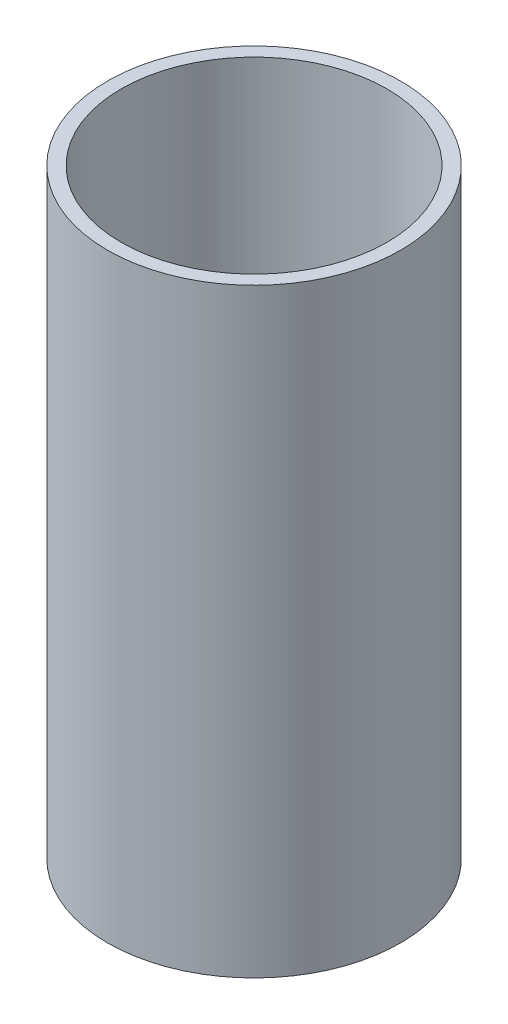
ISO-10303-21;
HEADER;
FILE_DESCRIPTION(('STEP AP214'),'2;1');
FILE_NAME('part.step','',(''),(''),'','','');
FILE_SCHEMA(('AUTOMOTIVE_DESIGN { 1 0 10303 214 1 1 1 1 }'));
ENDSEC;
DATA;
#1=APPLICATION_CONTEXT('core data for automotive mechanical design processes');
#2=APPLICATION_PROTOCOL_DEFINITION('international standard','automotive_design',2000,#1);
#3=PRODUCT_CONTEXT('',#1,'mechanical');
#4=PRODUCT('Part','Part','',(#3));
#5=PRODUCT_RELATED_PRODUCT_CATEGORY('part','',(#4));
#6=PRODUCT_DEFINITION_FORMATION('','',#4);
#7=PRODUCT_DEFINITION_CONTEXT('part definition',#1,'design');
#8=PRODUCT_DEFINITION('design','',#6,#7);
#9=PRODUCT_DEFINITION_SHAPE('','',#8);
#10=(LENGTH_UNIT() NAMED_UNIT(*) SI_UNIT(.MILLI.,.METRE.));
#11=(NAMED_UNIT(*) PLANE_ANGLE_UNIT() SI_UNIT($,.RADIAN.));
#12=(NAMED_UNIT(*) SI_UNIT($,.STERADIAN.) SOLID_ANGLE_UNIT());
#13=UNCERTAINTY_MEASURE_WITH_UNIT(LENGTH_MEASURE(1.E-05),#10,'distance_accuracy_value','');
#14=(GEOMETRIC_REPRESENTATION_CONTEXT(3) GLOBAL_UNCERTAINTY_ASSIGNED_CONTEXT((#13)) GLOBAL_UNIT_ASSIGNED_CONTEXT((#10,
#11,#12)) REPRESENTATION_CONTEXT('',''));
#15=CARTESIAN_POINT('',(0.,0.,0.));
#16=DIRECTION('',(0.,0.,1.));
#17=DIRECTION('',(1.,0.,0.));
#18=AXIS2_PLACEMENT_3D('',#15,#16,#17);
#19=CARTESIAN_POINT('',(0.,44.,0.));
#20=DIRECTION('',(0.,-1.,0.));
#21=DIRECTION('',(0.,0.,-1.));
#22=AXIS2_PLACEMENT_3D('',#19,#20,#21);
#23=CYLINDRICAL_SURFACE('',#22,9.75);
#24=CARTESIAN_POINT('',(0.,44.,0.));
#25=DIRECTION('',(0.,1.,0.));
#26=DIRECTION('',(0.,0.,1.));
#27=AXIS2_PLACEMENT_3D('',#24,#25,#26);
#28=CIRCLE('',#27,9.75);
#29=CARTESIAN_POINT('',(0.,44.,9.75));
#30=VERTEX_POINT('',#29);
#31=EDGE_CURVE('E51',#30,#30,#28,.T.);
#32=ORIENTED_EDGE('',*,*,#31,.T.);
#33=EDGE_LOOP('',(#32));
#34=FACE_BOUND('',#33,.T.);
#35=CARTESIAN_POINT('',(0.,0.,0.));
#36=DIRECTION('',(0.,1.,0.));
#37=DIRECTION('',(0.,0.,1.));
#38=AXIS2_PLACEMENT_3D('',#35,#36,#37);
#39=CIRCLE('',#38,9.75);
#40=CARTESIAN_POINT('',(0.,0.,9.75));
#41=VERTEX_POINT('',#40);
#42=EDGE_CURVE('E58',#41,#41,#39,.T.);
#43=ORIENTED_EDGE('',*,*,#42,.F.);
#44=EDGE_LOOP('',(#43));
#45=FACE_BOUND('',#44,.T.);
#46=ADVANCED_FACE('F43',(#34,#45),#23,.F.);
#47=CARTESIAN_POINT('',(0.,44.,0.));
#48=DIRECTION('',(0.,-1.,0.));
#49=DIRECTION('',(0.,0.,-1.));
#50=AXIS2_PLACEMENT_3D('',#47,#48,#49);
#51=CYLINDRICAL_SURFACE('',#50,10.75);
#52=CARTESIAN_POINT('',(0.,44.,0.));
#53=DIRECTION('',(0.,1.,0.));
#54=DIRECTION('',(0.,0.,1.));
#55=AXIS2_PLACEMENT_3D('',#52,#53,#54);
#56=CIRCLE('',#55,10.75);
#57=CARTESIAN_POINT('',(0.,44.,10.75));
#58=VERTEX_POINT('',#57);
#59=EDGE_CURVE('E10',#58,#58,#56,.T.);
#60=ORIENTED_EDGE('',*,*,#59,.F.);
#61=EDGE_LOOP('',(#60));
#62=FACE_BOUND('',#61,.T.);
#63=CARTESIAN_POINT('',(0.,0.,0.));
#64=DIRECTION('',(0.,1.,0.));
#65=DIRECTION('',(0.,0.,1.));
#66=AXIS2_PLACEMENT_3D('',#63,#64,#65);
#67=CIRCLE('',#66,10.75);
#68=CARTESIAN_POINT('',(0.,0.,10.75));
#69=VERTEX_POINT('',#68);
#70=EDGE_CURVE('E46',#69,#69,#67,.T.);
#71=ORIENTED_EDGE('',*,*,#70,.T.);
#72=EDGE_LOOP('',(#71));
#73=FACE_BOUND('',#72,.T.);
#74=ADVANCED_FACE('F67',(#62,#73),#51,.T.);
#75=CARTESIAN_POINT('',(0.,44.,0.));
#76=DIRECTION('',(0.,1.,0.));
#77=DIRECTION('',(0.,0.,1.));
#78=AXIS2_PLACEMENT_3D('',#75,#76,#77);
#79=PLANE('',#78);
#80=ORIENTED_EDGE('',*,*,#31,.F.);
#81=EDGE_LOOP('',(#80));
#82=FACE_BOUND('',#81,.T.);
#83=ORIENTED_EDGE('',*,*,#59,.T.);
#84=EDGE_LOOP('',(#83));
#85=FACE_BOUND('',#84,.T.);
#86=ADVANCED_FACE('F71',(#82,#85),#79,.T.);
#87=CARTESIAN_POINT('',(0.,0.,0.));
#88=DIRECTION('',(0.,1.,0.));
#89=DIRECTION('',(0.,0.,1.));
#90=AXIS2_PLACEMENT_3D('',#87,#88,#89);
#91=PLANE('',#90);
#92=ORIENTED_EDGE('',*,*,#42,.T.);
#93=EDGE_LOOP('',(#92));
#94=FACE_BOUND('',#93,.T.);
#95=ORIENTED_EDGE('',*,*,#70,.F.);
#96=EDGE_LOOP('',(#95));
#97=FACE_BOUND('',#96,.T.);
#98=ADVANCED_FACE('F69',(#94,#97),#91,.F.);
#99=CLOSED_SHELL('',(#46,#74,#86,#98));
#100=MANIFOLD_SOLID_BREP('B2',#99);
#101=ADVANCED_BREP_SHAPE_REPRESENTATION('',(#18,#100),#14);
#102=SHAPE_DEFINITION_REPRESENTATION(#9,#101);
ENDSEC;
END-ISO-10303-21;
